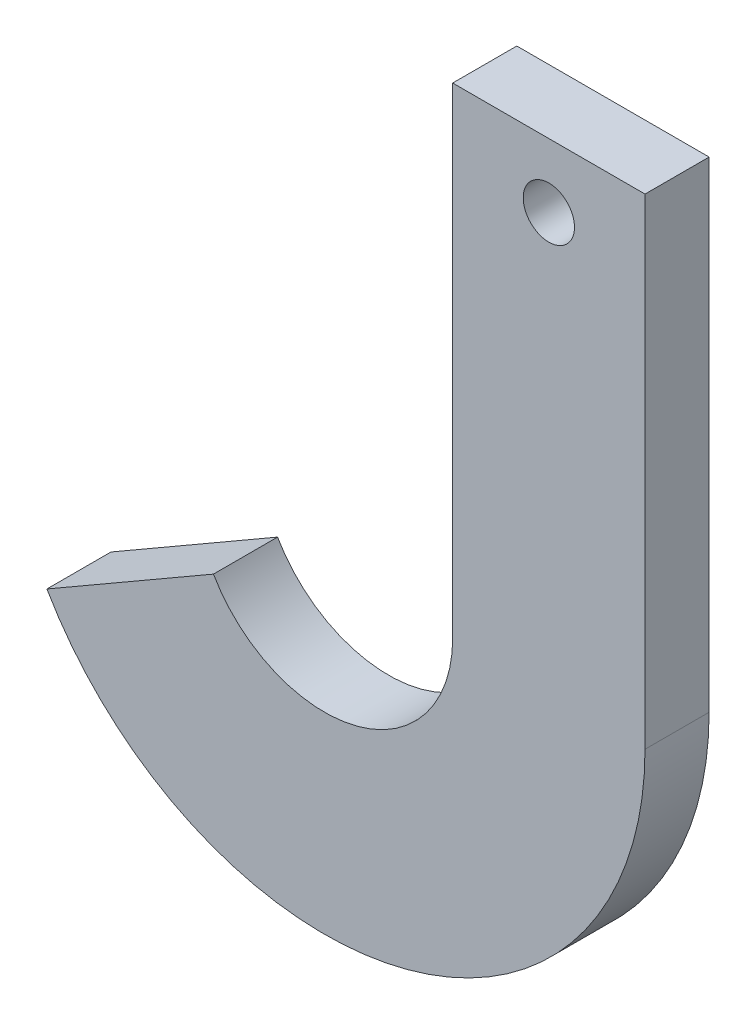
ISO-10303-21;
HEADER;
FILE_DESCRIPTION(('STEP AP214'),'2;1');
FILE_NAME('part.step','',(''),(''),'','','');
FILE_SCHEMA(('AUTOMOTIVE_DESIGN { 1 0 10303 214 1 1 1 1 }'));
ENDSEC;
DATA;
#1=APPLICATION_CONTEXT('core data for automotive mechanical design processes');
#2=APPLICATION_PROTOCOL_DEFINITION('international standard','automotive_design',2000,#1);
#3=PRODUCT_CONTEXT('',#1,'mechanical');
#4=PRODUCT('Part','Part','',(#3));
#5=PRODUCT_RELATED_PRODUCT_CATEGORY('part','',(#4));
#6=PRODUCT_DEFINITION_FORMATION('','',#4);
#7=PRODUCT_DEFINITION_CONTEXT('part definition',#1,'design');
#8=PRODUCT_DEFINITION('design','',#6,#7);
#9=PRODUCT_DEFINITION_SHAPE('','',#8);
#10=(LENGTH_UNIT() NAMED_UNIT(*) SI_UNIT(.MILLI.,.METRE.));
#11=(NAMED_UNIT(*) PLANE_ANGLE_UNIT() SI_UNIT($,.RADIAN.));
#12=(NAMED_UNIT(*) SI_UNIT($,.STERADIAN.) SOLID_ANGLE_UNIT());
#13=UNCERTAINTY_MEASURE_WITH_UNIT(LENGTH_MEASURE(1.E-05),#10,'distance_accuracy_value','');
#14=(GEOMETRIC_REPRESENTATION_CONTEXT(3) GLOBAL_UNCERTAINTY_ASSIGNED_CONTEXT((#13)) GLOBAL_UNIT_ASSIGNED_CONTEXT((#10,
#11,#12)) REPRESENTATION_CONTEXT('',''));
#15=CARTESIAN_POINT('',(0.,0.,0.));
#16=DIRECTION('',(0.,0.,1.));
#17=DIRECTION('',(1.,0.,0.));
#18=AXIS2_PLACEMENT_3D('',#15,#16,#17);
#19=CARTESIAN_POINT('',(70.,130.,20.));
#20=DIRECTION('',(0.,0.,-1.));
#21=DIRECTION('',(-1.,0.,0.));
#22=AXIS2_PLACEMENT_3D('',#19,#20,#21);
#23=CYLINDRICAL_SURFACE('',#22,8.00000000000001);
#24=CARTESIAN_POINT('',(70.,130.,0.));
#25=DIRECTION('',(0.,0.,1.));
#26=DIRECTION('',(1.,0.,0.));
#27=AXIS2_PLACEMENT_3D('',#24,#25,#26);
#28=CIRCLE('',#27,8.00000000000001);
#29=CARTESIAN_POINT('',(76.,135.291502622129,0.));
#30=VERTEX_POINT('',#29);
#31=CARTESIAN_POINT('',(76.,124.708497377871,0.));
#32=VERTEX_POINT('',#31);
#33=EDGE_CURVE('E162',#30,#32,#28,.T.);
#34=ORIENTED_EDGE('',*,*,#33,.F.);
#35=DIRECTION('',(0.,0.,1.));
#36=VECTOR('',#35,1.);
#37=CARTESIAN_POINT('',(76.,135.291502622129,20.));
#38=LINE('',#37,#36);
#39=CARTESIAN_POINT('',(76.,135.291502622129,20.));
#40=VERTEX_POINT('',#39);
#41=EDGE_CURVE('E12',#30,#40,#38,.T.);
#42=ORIENTED_EDGE('',*,*,#41,.T.);
#43=CARTESIAN_POINT('',(70.,130.,20.));
#44=DIRECTION('',(0.,0.,1.));
#45=DIRECTION('',(1.,0.,0.));
#46=AXIS2_PLACEMENT_3D('',#43,#44,#45);
#47=CIRCLE('',#46,8.00000000000001);
#48=CARTESIAN_POINT('',(76.,124.708497377871,20.));
#49=VERTEX_POINT('',#48);
#50=EDGE_CURVE('E161',#40,#49,#47,.T.);
#51=ORIENTED_EDGE('',*,*,#50,.T.);
#52=DIRECTION('',(0.,0.,-1.));
#53=VECTOR('',#52,1.);
#54=CARTESIAN_POINT('',(76.,124.708497377871,20.));
#55=LINE('',#54,#53);
#56=EDGE_CURVE('E47',#49,#32,#55,.T.);
#57=ORIENTED_EDGE('',*,*,#56,.T.);
#58=EDGE_LOOP('',(#34,#42,#51,#57));
#59=FACE_BOUND('',#58,.T.);
#60=ADVANCED_FACE('F39',(#59),#23,.F.);
#61=CARTESIAN_POINT('',(0.,0.,20.));
#62=DIRECTION('',(0.,0.,1.));
#63=DIRECTION('',(1.,0.,0.));
#64=AXIS2_PLACEMENT_3D('',#61,#62,#63);
#65=PLANE('',#64);
#66=CARTESIAN_POINT('',(0.,0.,20.));
#67=DIRECTION('',(0.,0.,-1.));
#68=DIRECTION('',(1.,0.,0.));
#69=AXIS2_PLACEMENT_3D('',#66,#67,#68);
#70=CIRCLE('',#69,40.);
#71=CARTESIAN_POINT('',(40.,0.,20.));
#72=VERTEX_POINT('',#71);
#73=CARTESIAN_POINT('',(-34.6410161513775,-20.0000000000001,20.));
#74=VERTEX_POINT('',#73);
#75=EDGE_CURVE('E112',#72,#74,#70,.T.);
#76=ORIENTED_EDGE('',*,*,#75,.T.);
#77=DIRECTION('',(-0.866025403784438,-0.500000000000001,0.));
#78=VECTOR('',#77,1.);
#79=CARTESIAN_POINT('',(-34.6410161513775,-20.0000000000001,20.));
#80=LINE('',#79,#78);
#81=CARTESIAN_POINT('',(-86.6025403784438,-50.0000000000001,20.));
#82=VERTEX_POINT('',#81);
#83=EDGE_CURVE('E101',#74,#82,#80,.T.);
#84=ORIENTED_EDGE('',*,*,#83,.T.);
#85=CARTESIAN_POINT('',(0.,0.,20.));
#86=DIRECTION('',(0.,0.,1.));
#87=DIRECTION('',(1.,0.,0.));
#88=AXIS2_PLACEMENT_3D('',#85,#86,#87);
#89=CIRCLE('',#88,100.);
#90=CARTESIAN_POINT('',(100.,0.,20.));
#91=VERTEX_POINT('',#90);
#92=EDGE_CURVE('E111',#82,#91,#89,.T.);
#93=ORIENTED_EDGE('',*,*,#92,.T.);
#94=DIRECTION('',(0.,1.,0.));
#95=VECTOR('',#94,1.);
#96=CARTESIAN_POINT('',(100.,0.,20.));
#97=LINE('',#96,#95);
#98=CARTESIAN_POINT('',(100.,150.,20.));
#99=VERTEX_POINT('',#98);
#100=EDGE_CURVE('E155',#91,#99,#97,.T.);
#101=ORIENTED_EDGE('',*,*,#100,.T.);
#102=DIRECTION('',(-1.,0.,0.));
#103=VECTOR('',#102,1.);
#104=CARTESIAN_POINT('',(40.,150.,20.));
#105=LINE('',#104,#103);
#106=CARTESIAN_POINT('',(40.,150.,20.));
#107=VERTEX_POINT('',#106);
#108=EDGE_CURVE('E153',#99,#107,#105,.T.);
#109=ORIENTED_EDGE('',*,*,#108,.T.);
#110=DIRECTION('',(0.,-1.,0.));
#111=VECTOR('',#110,1.);
#112=CARTESIAN_POINT('',(40.,150.,20.));
#113=LINE('',#112,#111);
#114=EDGE_CURVE('E118',#107,#72,#113,.T.);
#115=ORIENTED_EDGE('',*,*,#114,.T.);
#116=EDGE_LOOP('',(#76,#84,#93,#101,#109,#115));
#117=FACE_BOUND('',#116,.T.);
#118=EDGE_CURVE('E151',#49,#40,#47,.T.);
#119=ORIENTED_EDGE('',*,*,#118,.F.);
#120=ORIENTED_EDGE('',*,*,#50,.F.);
#121=EDGE_LOOP('',(#119,#120));
#122=FACE_BOUND('',#121,.T.);
#123=ADVANCED_FACE('F115',(#117,#122),#65,.T.);
#124=CARTESIAN_POINT('',(0.,0.,0.));
#125=DIRECTION('',(0.,0.,1.));
#126=DIRECTION('',(1.,0.,0.));
#127=AXIS2_PLACEMENT_3D('',#124,#125,#126);
#128=PLANE('',#127);
#129=CARTESIAN_POINT('',(0.,0.,0.));
#130=DIRECTION('',(0.,0.,-1.));
#131=DIRECTION('',(1.,0.,0.));
#132=AXIS2_PLACEMENT_3D('',#129,#130,#131);
#133=CIRCLE('',#132,40.);
#134=CARTESIAN_POINT('',(40.,0.,0.));
#135=VERTEX_POINT('',#134);
#136=CARTESIAN_POINT('',(-34.6410161513775,-20.0000000000001,0.));
#137=VERTEX_POINT('',#136);
#138=EDGE_CURVE('E125',#135,#137,#133,.T.);
#139=ORIENTED_EDGE('',*,*,#138,.F.);
#140=DIRECTION('',(0.,-1.,0.));
#141=VECTOR('',#140,1.);
#142=CARTESIAN_POINT('',(40.,150.,0.));
#143=LINE('',#142,#141);
#144=CARTESIAN_POINT('',(40.,150.,0.));
#145=VERTEX_POINT('',#144);
#146=EDGE_CURVE('E122',#145,#135,#143,.T.);
#147=ORIENTED_EDGE('',*,*,#146,.F.);
#148=DIRECTION('',(-1.,0.,0.));
#149=VECTOR('',#148,1.);
#150=CARTESIAN_POINT('',(40.,150.,0.));
#151=LINE('',#150,#149);
#152=CARTESIAN_POINT('',(100.,150.,0.));
#153=VERTEX_POINT('',#152);
#154=EDGE_CURVE('E142',#153,#145,#151,.T.);
#155=ORIENTED_EDGE('',*,*,#154,.F.);
#156=DIRECTION('',(0.,1.,0.));
#157=VECTOR('',#156,1.);
#158=CARTESIAN_POINT('',(100.,0.,0.));
#159=LINE('',#158,#157);
#160=CARTESIAN_POINT('',(100.,0.,0.));
#161=VERTEX_POINT('',#160);
#162=EDGE_CURVE('E144',#161,#153,#159,.T.);
#163=ORIENTED_EDGE('',*,*,#162,.F.);
#164=CARTESIAN_POINT('',(0.,0.,0.));
#165=DIRECTION('',(0.,0.,1.));
#166=DIRECTION('',(1.,0.,0.));
#167=AXIS2_PLACEMENT_3D('',#164,#165,#166);
#168=CIRCLE('',#167,100.);
#169=CARTESIAN_POINT('',(-86.6025403784438,-50.0000000000001,0.));
#170=VERTEX_POINT('',#169);
#171=EDGE_CURVE('E146',#170,#161,#168,.T.);
#172=ORIENTED_EDGE('',*,*,#171,.F.);
#173=DIRECTION('',(-0.866025403784438,-0.500000000000001,0.));
#174=VECTOR('',#173,1.);
#175=CARTESIAN_POINT('',(-34.6410161513775,-20.0000000000001,0.));
#176=LINE('',#175,#174);
#177=EDGE_CURVE('E148',#137,#170,#176,.T.);
#178=ORIENTED_EDGE('',*,*,#177,.F.);
#179=EDGE_LOOP('',(#139,#147,#155,#163,#172,#178));
#180=FACE_BOUND('',#179,.T.);
#181=EDGE_CURVE('E158',#32,#30,#28,.T.);
#182=ORIENTED_EDGE('',*,*,#181,.T.);
#183=ORIENTED_EDGE('',*,*,#33,.T.);
#184=EDGE_LOOP('',(#182,#183));
#185=FACE_BOUND('',#184,.T.);
#186=ADVANCED_FACE('F167',(#180,#185),#128,.F.);
#187=CARTESIAN_POINT('',(0.,0.,20.));
#188=DIRECTION('',(0.,0.,-1.));
#189=DIRECTION('',(-1.,0.,0.));
#190=AXIS2_PLACEMENT_3D('',#187,#188,#189);
#191=CYLINDRICAL_SURFACE('',#190,40.);
#192=ORIENTED_EDGE('',*,*,#138,.T.);
#193=DIRECTION('',(0.,0.,-1.));
#194=VECTOR('',#193,1.);
#195=CARTESIAN_POINT('',(-34.6410161513775,-20.0000000000001,20.));
#196=LINE('',#195,#194);
#197=EDGE_CURVE('E105',#74,#137,#196,.T.);
#198=ORIENTED_EDGE('',*,*,#197,.F.);
#199=ORIENTED_EDGE('',*,*,#75,.F.);
#200=DIRECTION('',(0.,0.,-1.));
#201=VECTOR('',#200,1.);
#202=CARTESIAN_POINT('',(40.,0.,20.));
#203=LINE('',#202,#201);
#204=EDGE_CURVE('E139',#72,#135,#203,.T.);
#205=ORIENTED_EDGE('',*,*,#204,.T.);
#206=EDGE_LOOP('',(#192,#198,#199,#205));
#207=FACE_BOUND('',#206,.T.);
#208=ADVANCED_FACE('F41',(#207),#191,.F.);
#209=CARTESIAN_POINT('',(-34.6410161513775,-20.0000000000001,20.));
#210=DIRECTION('',(0.500000000000001,-0.866025403784438,0.));
#211=DIRECTION('',(0.866025403784438,0.500000000000001,0.));
#212=AXIS2_PLACEMENT_3D('',#209,#210,#211);
#213=PLANE('',#212);
#214=ORIENTED_EDGE('',*,*,#177,.T.);
#215=DIRECTION('',(0.,0.,-1.));
#216=VECTOR('',#215,1.);
#217=CARTESIAN_POINT('',(-86.6025403784438,-50.0000000000001,20.));
#218=LINE('',#217,#216);
#219=EDGE_CURVE('E108',#82,#170,#218,.T.);
#220=ORIENTED_EDGE('',*,*,#219,.F.);
#221=ORIENTED_EDGE('',*,*,#83,.F.);
#222=ORIENTED_EDGE('',*,*,#197,.T.);
#223=EDGE_LOOP('',(#214,#220,#221,#222));
#224=FACE_BOUND('',#223,.T.);
#225=ADVANCED_FACE('F103',(#224),#213,.F.);
#226=CARTESIAN_POINT('',(0.,0.,20.));
#227=DIRECTION('',(0.,0.,-1.));
#228=DIRECTION('',(-1.,0.,0.));
#229=AXIS2_PLACEMENT_3D('',#226,#227,#228);
#230=CYLINDRICAL_SURFACE('',#229,100.);
#231=ORIENTED_EDGE('',*,*,#171,.T.);
#232=DIRECTION('',(0.,0.,-1.));
#233=VECTOR('',#232,1.);
#234=CARTESIAN_POINT('',(100.,0.,20.));
#235=LINE('',#234,#233);
#236=EDGE_CURVE('E128',#91,#161,#235,.T.);
#237=ORIENTED_EDGE('',*,*,#236,.F.);
#238=ORIENTED_EDGE('',*,*,#92,.F.);
#239=ORIENTED_EDGE('',*,*,#219,.T.);
#240=EDGE_LOOP('',(#231,#237,#238,#239));
#241=FACE_BOUND('',#240,.T.);
#242=ADVANCED_FACE('F188',(#241),#230,.T.);
#243=CARTESIAN_POINT('',(100.,0.,20.));
#244=DIRECTION('',(-1.,0.,0.));
#245=DIRECTION('',(0.,0.,1.));
#246=AXIS2_PLACEMENT_3D('',#243,#244,#245);
#247=PLANE('',#246);
#248=ORIENTED_EDGE('',*,*,#162,.T.);
#249=DIRECTION('',(0.,0.,-1.));
#250=VECTOR('',#249,1.);
#251=CARTESIAN_POINT('',(100.,150.,20.));
#252=LINE('',#251,#250);
#253=EDGE_CURVE('E133',#99,#153,#252,.T.);
#254=ORIENTED_EDGE('',*,*,#253,.F.);
#255=ORIENTED_EDGE('',*,*,#100,.F.);
#256=ORIENTED_EDGE('',*,*,#236,.T.);
#257=EDGE_LOOP('',(#248,#254,#255,#256));
#258=FACE_BOUND('',#257,.T.);
#259=ADVANCED_FACE('F184',(#258),#247,.F.);
#260=CARTESIAN_POINT('',(40.,150.,20.));
#261=DIRECTION('',(0.,-1.,0.));
#262=DIRECTION('',(0.,0.,-1.));
#263=AXIS2_PLACEMENT_3D('',#260,#261,#262);
#264=PLANE('',#263);
#265=ORIENTED_EDGE('',*,*,#154,.T.);
#266=DIRECTION('',(0.,0.,-1.));
#267=VECTOR('',#266,1.);
#268=CARTESIAN_POINT('',(40.,150.,20.));
#269=LINE('',#268,#267);
#270=EDGE_CURVE('E136',#107,#145,#269,.T.);
#271=ORIENTED_EDGE('',*,*,#270,.F.);
#272=ORIENTED_EDGE('',*,*,#108,.F.);
#273=ORIENTED_EDGE('',*,*,#253,.T.);
#274=EDGE_LOOP('',(#265,#271,#272,#273));
#275=FACE_BOUND('',#274,.T.);
#276=ADVANCED_FACE('F180',(#275),#264,.F.);
#277=CARTESIAN_POINT('',(40.,150.,20.));
#278=DIRECTION('',(1.,0.,0.));
#279=DIRECTION('',(0.,1.,0.));
#280=AXIS2_PLACEMENT_3D('',#277,#278,#279);
#281=PLANE('',#280);
#282=ORIENTED_EDGE('',*,*,#146,.T.);
#283=ORIENTED_EDGE('',*,*,#204,.F.);
#284=ORIENTED_EDGE('',*,*,#114,.F.);
#285=ORIENTED_EDGE('',*,*,#270,.T.);
#286=EDGE_LOOP('',(#282,#283,#284,#285));
#287=FACE_BOUND('',#286,.T.);
#288=ADVANCED_FACE('F177',(#287),#281,.F.);
#289=ORIENTED_EDGE('',*,*,#41,.F.);
#290=ORIENTED_EDGE('',*,*,#181,.F.);
#291=ORIENTED_EDGE('',*,*,#56,.F.);
#292=ORIENTED_EDGE('',*,*,#118,.T.);
#293=EDGE_LOOP('',(#289,#290,#291,#292));
#294=FACE_BOUND('',#293,.T.);
#295=ADVANCED_FACE('F165',(#294),#23,.F.);
#296=CLOSED_SHELL('',(#60,#123,#186,#208,#225,#242,#259,#276,#288,#295));
#297=MANIFOLD_SOLID_BREP('B2',#296);
#298=ADVANCED_BREP_SHAPE_REPRESENTATION('',(#18,#297),#14);
#299=SHAPE_DEFINITION_REPRESENTATION(#9,#298);
ENDSEC;
END-ISO-10303-21;
